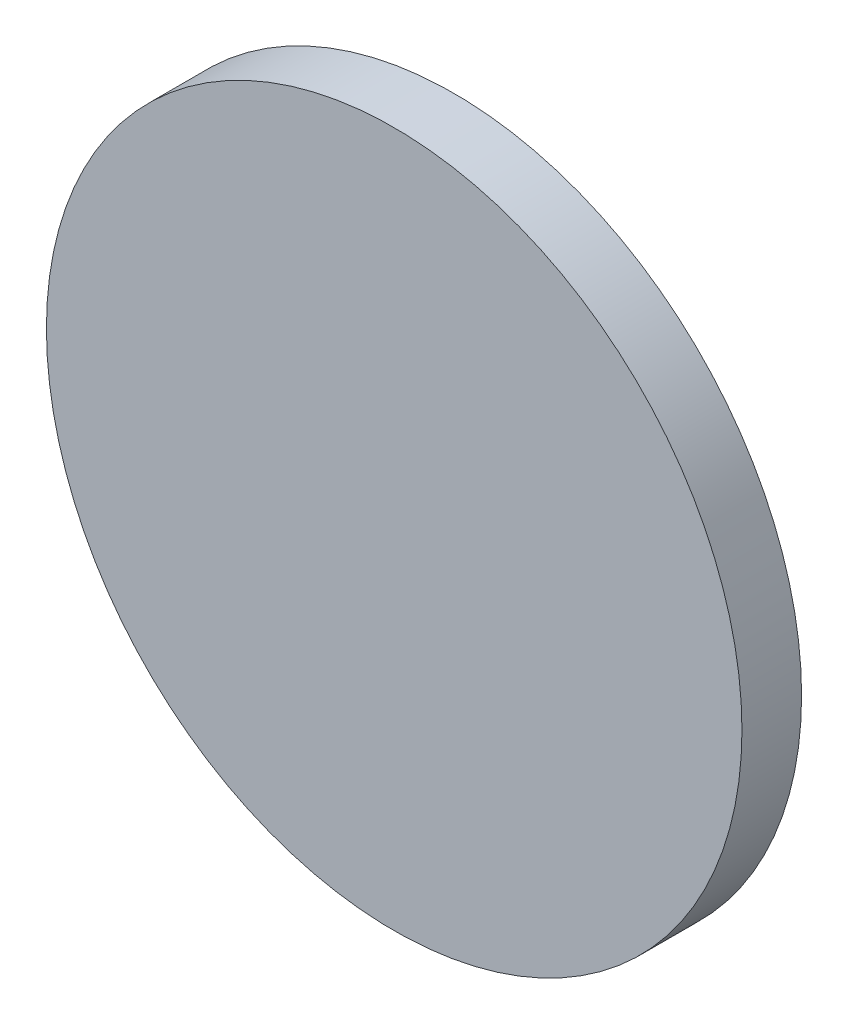
ISO-10303-21;
HEADER;
FILE_DESCRIPTION(('STEP AP214'),'2;1');
FILE_NAME('part.step','',(''),(''),'','','');
FILE_SCHEMA(('AUTOMOTIVE_DESIGN { 1 0 10303 214 1 1 1 1 }'));
ENDSEC;
DATA;
#1=APPLICATION_CONTEXT('core data for automotive mechanical design processes');
#2=APPLICATION_PROTOCOL_DEFINITION('international standard','automotive_design',2000,#1);
#3=PRODUCT_CONTEXT('',#1,'mechanical');
#4=PRODUCT('Part','Part','',(#3));
#5=PRODUCT_RELATED_PRODUCT_CATEGORY('part','',(#4));
#6=PRODUCT_DEFINITION_FORMATION('','',#4);
#7=PRODUCT_DEFINITION_CONTEXT('part definition',#1,'design');
#8=PRODUCT_DEFINITION('design','',#6,#7);
#9=PRODUCT_DEFINITION_SHAPE('','',#8);
#10=(LENGTH_UNIT() NAMED_UNIT(*) SI_UNIT(.MILLI.,.METRE.));
#11=(NAMED_UNIT(*) PLANE_ANGLE_UNIT() SI_UNIT($,.RADIAN.));
#12=(NAMED_UNIT(*) SI_UNIT($,.STERADIAN.) SOLID_ANGLE_UNIT());
#13=UNCERTAINTY_MEASURE_WITH_UNIT(LENGTH_MEASURE(1.E-05),#10,'distance_accuracy_value','');
#14=(GEOMETRIC_REPRESENTATION_CONTEXT(3) GLOBAL_UNCERTAINTY_ASSIGNED_CONTEXT((#13)) GLOBAL_UNIT_ASSIGNED_CONTEXT((#10,
#11,#12)) REPRESENTATION_CONTEXT('',''));
#15=CARTESIAN_POINT('',(0.,0.,0.));
#16=DIRECTION('',(0.,0.,1.));
#17=DIRECTION('',(1.,0.,0.));
#18=AXIS2_PLACEMENT_3D('',#15,#16,#17);
#19=CARTESIAN_POINT('',(2.149282667,11.133645333,0.79916));
#20=DIRECTION('',(0.,0.,1.));
#21=DIRECTION('',(1.,0.,0.));
#22=AXIS2_PLACEMENT_3D('',#19,#20,#21);
#23=PLANE('',#22);
#24=CARTESIAN_POINT('',(2.149282667,11.133645333,0.79916));
#25=DIRECTION('',(0.,0.,1.));
#26=DIRECTION('',(1.,0.,0.));
#27=AXIS2_PLACEMENT_3D('',#24,#25,#26);
#28=CIRCLE('',#27,0.2);
#29=CARTESIAN_POINT('',(2.349282667,11.133645333,0.79916));
#30=VERTEX_POINT('',#29);
#31=EDGE_CURVE('E18',#30,#30,#28,.F.);
#32=ORIENTED_EDGE('',*,*,#31,.F.);
#33=EDGE_LOOP('',(#32));
#34=FACE_BOUND('',#33,.T.);
#35=ADVANCED_FACE('F15',(#34),#23,.T.);
#36=CARTESIAN_POINT('',(2.149282667,11.133645333,0.76487));
#37=DIRECTION('',(0.,0.,1.));
#38=DIRECTION('',(1.,0.,0.));
#39=AXIS2_PLACEMENT_3D('',#36,#37,#38);
#40=CYLINDRICAL_SURFACE('',#39,0.2);
#41=ORIENTED_EDGE('',*,*,#31,.T.);
#42=EDGE_LOOP('',(#41));
#43=FACE_BOUND('',#42,.T.);
#44=CARTESIAN_POINT('',(2.149282667,11.133645333,0.76487));
#45=DIRECTION('',(0.,0.,1.));
#46=DIRECTION('',(1.,0.,0.));
#47=AXIS2_PLACEMENT_3D('',#44,#45,#46);
#48=CIRCLE('',#47,0.2);
#49=CARTESIAN_POINT('',(2.349282667,11.133645333,0.76487));
#50=VERTEX_POINT('',#49);
#51=EDGE_CURVE('E10',#50,#50,#48,.F.);
#52=ORIENTED_EDGE('',*,*,#51,.F.);
#53=EDGE_LOOP('',(#52));
#54=FACE_BOUND('',#53,.T.);
#55=ADVANCED_FACE('F27',(#43,#54),#40,.T.);
#56=CARTESIAN_POINT('',(2.149282667,11.133645333,0.76487));
#57=DIRECTION('',(0.,0.,-1.));
#58=DIRECTION('',(-1.,0.,0.));
#59=AXIS2_PLACEMENT_3D('',#56,#57,#58);
#60=PLANE('',#59);
#61=ORIENTED_EDGE('',*,*,#51,.T.);
#62=EDGE_LOOP('',(#61));
#63=FACE_BOUND('',#62,.T.);
#64=ADVANCED_FACE('F35',(#63),#60,.T.);
#65=CLOSED_SHELL('',(#35,#55,#64));
#66=MANIFOLD_SOLID_BREP('B1',#65);
#67=ADVANCED_BREP_SHAPE_REPRESENTATION('',(#18,#66),#14);
#68=SHAPE_DEFINITION_REPRESENTATION(#9,#67);
ENDSEC;
END-ISO-10303-21;
